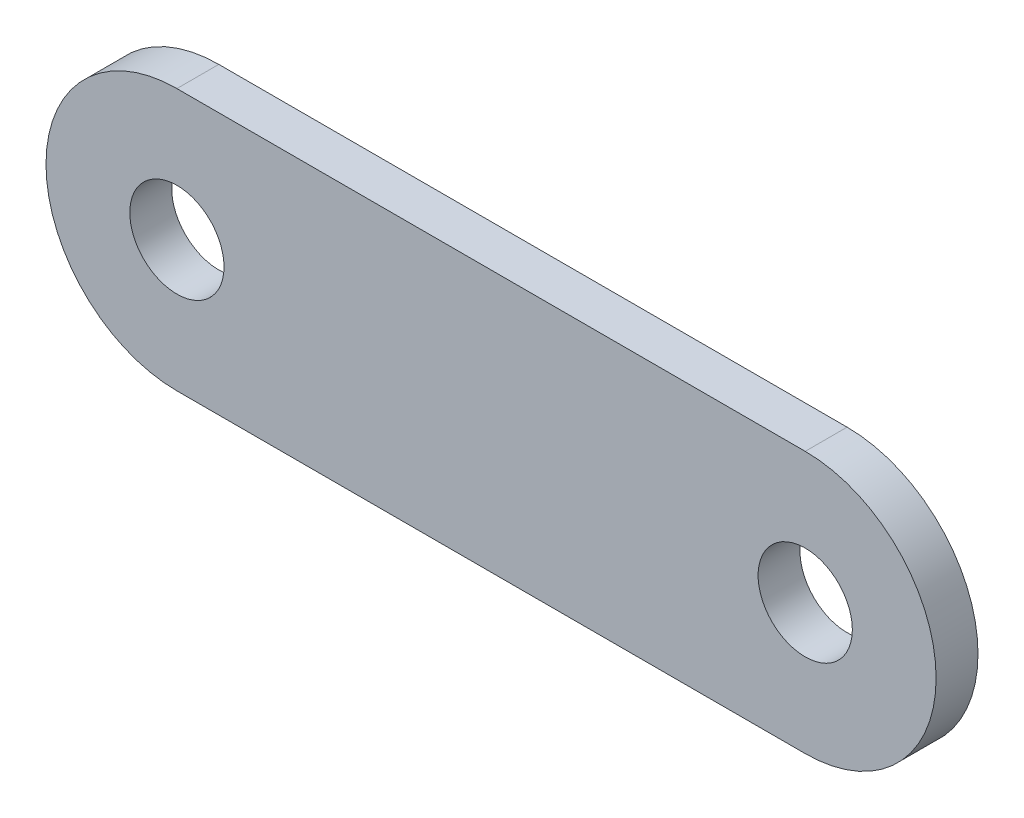
ISO-10303-21;
HEADER;
FILE_DESCRIPTION(('STEP AP214'),'2;1');
FILE_NAME('part.step','',(''),(''),'','','');
FILE_SCHEMA(('AUTOMOTIVE_DESIGN { 1 0 10303 214 1 1 1 1 }'));
ENDSEC;
DATA;
#1=APPLICATION_CONTEXT('core data for automotive mechanical design processes');
#2=APPLICATION_PROTOCOL_DEFINITION('international standard','automotive_design',2000,#1);
#3=PRODUCT_CONTEXT('',#1,'mechanical');
#4=PRODUCT('Part','Part','',(#3));
#5=PRODUCT_RELATED_PRODUCT_CATEGORY('part','',(#4));
#6=PRODUCT_DEFINITION_FORMATION('','',#4);
#7=PRODUCT_DEFINITION_CONTEXT('part definition',#1,'design');
#8=PRODUCT_DEFINITION('design','',#6,#7);
#9=PRODUCT_DEFINITION_SHAPE('','',#8);
#10=(LENGTH_UNIT() NAMED_UNIT(*) SI_UNIT(.MILLI.,.METRE.));
#11=(NAMED_UNIT(*) PLANE_ANGLE_UNIT() SI_UNIT($,.RADIAN.));
#12=(NAMED_UNIT(*) SI_UNIT($,.STERADIAN.) SOLID_ANGLE_UNIT());
#13=UNCERTAINTY_MEASURE_WITH_UNIT(LENGTH_MEASURE(1.E-05),#10,'distance_accuracy_value','');
#14=(GEOMETRIC_REPRESENTATION_CONTEXT(3) GLOBAL_UNCERTAINTY_ASSIGNED_CONTEXT((#13)) GLOBAL_UNIT_ASSIGNED_CONTEXT((#10,
#11,#12)) REPRESENTATION_CONTEXT('',''));
#15=CARTESIAN_POINT('',(0.,0.,0.));
#16=DIRECTION('',(0.,0.,1.));
#17=DIRECTION('',(1.,0.,0.));
#18=AXIS2_PLACEMENT_3D('',#15,#16,#17);
#19=CARTESIAN_POINT('',(0.,0.,4.));
#20=DIRECTION('',(0.,0.,1.));
#21=DIRECTION('',(1.,0.,0.));
#22=AXIS2_PLACEMENT_3D('',#19,#20,#21);
#23=PLANE('',#22);
#24=CARTESIAN_POINT('',(0.,0.,4.));
#25=DIRECTION('',(0.,0.,1.));
#26=DIRECTION('',(1.,0.,0.));
#27=AXIS2_PLACEMENT_3D('',#24,#25,#26);
#28=CIRCLE('',#27,4.5);
#29=CARTESIAN_POINT('',(4.5,0.,4.));
#30=VERTEX_POINT('',#29);
#31=EDGE_CURVE('E100',#30,#30,#28,.T.);
#32=ORIENTED_EDGE('',*,*,#31,.F.);
#33=EDGE_LOOP('',(#32));
#34=FACE_BOUND('',#33,.T.);
#35=CARTESIAN_POINT('',(0.,0.,4.));
#36=DIRECTION('',(0.,0.,1.));
#37=DIRECTION('',(1.,0.,0.));
#38=AXIS2_PLACEMENT_3D('',#35,#36,#37);
#39=CIRCLE('',#38,12.5);
#40=CARTESIAN_POINT('',(0.,12.5,4.));
#41=VERTEX_POINT('',#40);
#42=CARTESIAN_POINT('',(0.,-12.5,4.));
#43=VERTEX_POINT('',#42);
#44=EDGE_CURVE('E85',#41,#43,#39,.T.);
#45=ORIENTED_EDGE('',*,*,#44,.T.);
#46=DIRECTION('',(1.,0.,0.));
#47=VECTOR('',#46,1.);
#48=CARTESIAN_POINT('',(0.,-12.5,4.));
#49=LINE('',#48,#47);
#50=CARTESIAN_POINT('',(60.,-12.5,4.));
#51=VERTEX_POINT('',#50);
#52=EDGE_CURVE('E80',#43,#51,#49,.T.);
#53=ORIENTED_EDGE('',*,*,#52,.T.);
#54=CARTESIAN_POINT('',(60.,0.,4.));
#55=DIRECTION('',(0.,0.,1.));
#56=DIRECTION('',(1.,0.,0.));
#57=AXIS2_PLACEMENT_3D('',#54,#55,#56);
#58=CIRCLE('',#57,12.5);
#59=CARTESIAN_POINT('',(60.,12.5,4.));
#60=VERTEX_POINT('',#59);
#61=EDGE_CURVE('E83',#51,#60,#58,.T.);
#62=ORIENTED_EDGE('',*,*,#61,.T.);
#63=DIRECTION('',(-1.,0.,0.));
#64=VECTOR('',#63,1.);
#65=CARTESIAN_POINT('',(0.,12.5,4.));
#66=LINE('',#65,#64);
#67=EDGE_CURVE('E50',#60,#41,#66,.T.);
#68=ORIENTED_EDGE('',*,*,#67,.T.);
#69=EDGE_LOOP('',(#45,#53,#62,#68));
#70=FACE_BOUND('',#69,.T.);
#71=CARTESIAN_POINT('',(60.,0.,4.));
#72=DIRECTION('',(0.,0.,1.));
#73=DIRECTION('',(1.,0.,0.));
#74=AXIS2_PLACEMENT_3D('',#71,#72,#73);
#75=CIRCLE('',#74,4.5);
#76=CARTESIAN_POINT('',(64.5,0.,4.));
#77=VERTEX_POINT('',#76);
#78=EDGE_CURVE('E115',#77,#77,#75,.T.);
#79=ORIENTED_EDGE('',*,*,#78,.F.);
#80=EDGE_LOOP('',(#79));
#81=FACE_BOUND('',#80,.T.);
#82=ADVANCED_FACE('F33',(#34,#70,#81),#23,.T.);
#83=CARTESIAN_POINT('',(0.,0.,0.));
#84=DIRECTION('',(0.,0.,1.));
#85=DIRECTION('',(1.,0.,0.));
#86=AXIS2_PLACEMENT_3D('',#83,#84,#85);
#87=PLANE('',#86);
#88=CARTESIAN_POINT('',(0.,0.,0.));
#89=DIRECTION('',(0.,0.,1.));
#90=DIRECTION('',(1.,0.,0.));
#91=AXIS2_PLACEMENT_3D('',#88,#89,#90);
#92=CIRCLE('',#91,12.5);
#93=CARTESIAN_POINT('',(0.,12.5,0.));
#94=VERTEX_POINT('',#93);
#95=CARTESIAN_POINT('',(0.,-12.5,0.));
#96=VERTEX_POINT('',#95);
#97=EDGE_CURVE('E97',#94,#96,#92,.T.);
#98=ORIENTED_EDGE('',*,*,#97,.F.);
#99=DIRECTION('',(-1.,0.,0.));
#100=VECTOR('',#99,1.);
#101=CARTESIAN_POINT('',(0.,12.5,0.));
#102=LINE('',#101,#100);
#103=CARTESIAN_POINT('',(60.,12.5,0.));
#104=VERTEX_POINT('',#103);
#105=EDGE_CURVE('E73',#104,#94,#102,.T.);
#106=ORIENTED_EDGE('',*,*,#105,.F.);
#107=CARTESIAN_POINT('',(60.,0.,0.));
#108=DIRECTION('',(0.,0.,1.));
#109=DIRECTION('',(1.,0.,0.));
#110=AXIS2_PLACEMENT_3D('',#107,#108,#109);
#111=CIRCLE('',#110,12.5);
#112=CARTESIAN_POINT('',(60.,-12.5,0.));
#113=VERTEX_POINT('',#112);
#114=EDGE_CURVE('E67',#113,#104,#111,.T.);
#115=ORIENTED_EDGE('',*,*,#114,.F.);
#116=DIRECTION('',(1.,0.,0.));
#117=VECTOR('',#116,1.);
#118=CARTESIAN_POINT('',(0.,-12.5,0.));
#119=LINE('',#118,#117);
#120=EDGE_CURVE('E89',#96,#113,#119,.T.);
#121=ORIENTED_EDGE('',*,*,#120,.F.);
#122=EDGE_LOOP('',(#98,#106,#115,#121));
#123=FACE_BOUND('',#122,.T.);
#124=CARTESIAN_POINT('',(0.,0.,0.));
#125=DIRECTION('',(0.,0.,1.));
#126=DIRECTION('',(1.,0.,0.));
#127=AXIS2_PLACEMENT_3D('',#124,#125,#126);
#128=CIRCLE('',#127,4.5);
#129=CARTESIAN_POINT('',(4.5,0.,0.));
#130=VERTEX_POINT('',#129);
#131=EDGE_CURVE('E112',#130,#130,#128,.T.);
#132=ORIENTED_EDGE('',*,*,#131,.T.);
#133=EDGE_LOOP('',(#132));
#134=FACE_BOUND('',#133,.T.);
#135=CARTESIAN_POINT('',(60.,0.,0.));
#136=DIRECTION('',(0.,0.,1.));
#137=DIRECTION('',(1.,0.,0.));
#138=AXIS2_PLACEMENT_3D('',#135,#136,#137);
#139=CIRCLE('',#138,4.5);
#140=CARTESIAN_POINT('',(64.5,0.,0.));
#141=VERTEX_POINT('',#140);
#142=EDGE_CURVE('E118',#141,#141,#139,.T.);
#143=ORIENTED_EDGE('',*,*,#142,.T.);
#144=EDGE_LOOP('',(#143));
#145=FACE_BOUND('',#144,.T.);
#146=ADVANCED_FACE('F108',(#123,#134,#145),#87,.F.);
#147=CARTESIAN_POINT('',(0.,0.,4.));
#148=DIRECTION('',(0.,0.,-1.));
#149=DIRECTION('',(-1.,0.,0.));
#150=AXIS2_PLACEMENT_3D('',#147,#148,#149);
#151=CYLINDRICAL_SURFACE('',#150,12.5);
#152=ORIENTED_EDGE('',*,*,#97,.T.);
#153=DIRECTION('',(0.,0.,-1.));
#154=VECTOR('',#153,1.);
#155=CARTESIAN_POINT('',(0.,-12.5,4.));
#156=LINE('',#155,#154);
#157=EDGE_CURVE('E11',#43,#96,#156,.T.);
#158=ORIENTED_EDGE('',*,*,#157,.F.);
#159=ORIENTED_EDGE('',*,*,#44,.F.);
#160=DIRECTION('',(0.,0.,-1.));
#161=VECTOR('',#160,1.);
#162=CARTESIAN_POINT('',(0.,12.5,4.));
#163=LINE('',#162,#161);
#164=EDGE_CURVE('E93',#41,#94,#163,.T.);
#165=ORIENTED_EDGE('',*,*,#164,.T.);
#166=EDGE_LOOP('',(#152,#158,#159,#165));
#167=FACE_BOUND('',#166,.T.);
#168=ADVANCED_FACE('F35',(#167),#151,.T.);
#169=CARTESIAN_POINT('',(0.,-12.5,4.));
#170=DIRECTION('',(0.,1.,0.));
#171=DIRECTION('',(0.,0.,1.));
#172=AXIS2_PLACEMENT_3D('',#169,#170,#171);
#173=PLANE('',#172);
#174=ORIENTED_EDGE('',*,*,#120,.T.);
#175=DIRECTION('',(0.,0.,-1.));
#176=VECTOR('',#175,1.);
#177=CARTESIAN_POINT('',(60.,-12.5,4.));
#178=LINE('',#177,#176);
#179=EDGE_CURVE('E42',#51,#113,#178,.T.);
#180=ORIENTED_EDGE('',*,*,#179,.F.);
#181=ORIENTED_EDGE('',*,*,#52,.F.);
#182=ORIENTED_EDGE('',*,*,#157,.T.);
#183=EDGE_LOOP('',(#174,#180,#181,#182));
#184=FACE_BOUND('',#183,.T.);
#185=ADVANCED_FACE('F88',(#184),#173,.F.);
#186=CARTESIAN_POINT('',(60.,0.,4.));
#187=DIRECTION('',(0.,0.,-1.));
#188=DIRECTION('',(-1.,0.,0.));
#189=AXIS2_PLACEMENT_3D('',#186,#187,#188);
#190=CYLINDRICAL_SURFACE('',#189,12.5);
#191=ORIENTED_EDGE('',*,*,#114,.T.);
#192=DIRECTION('',(0.,0.,-1.));
#193=VECTOR('',#192,1.);
#194=CARTESIAN_POINT('',(60.,12.5,4.));
#195=LINE('',#194,#193);
#196=EDGE_CURVE('E90',#60,#104,#195,.T.);
#197=ORIENTED_EDGE('',*,*,#196,.F.);
#198=ORIENTED_EDGE('',*,*,#61,.F.);
#199=ORIENTED_EDGE('',*,*,#179,.T.);
#200=EDGE_LOOP('',(#191,#197,#198,#199));
#201=FACE_BOUND('',#200,.T.);
#202=ADVANCED_FACE('F91',(#201),#190,.T.);
#203=CARTESIAN_POINT('',(0.,12.5,4.));
#204=DIRECTION('',(0.,-1.,0.));
#205=DIRECTION('',(0.,0.,-1.));
#206=AXIS2_PLACEMENT_3D('',#203,#204,#205);
#207=PLANE('',#206);
#208=ORIENTED_EDGE('',*,*,#105,.T.);
#209=ORIENTED_EDGE('',*,*,#164,.F.);
#210=ORIENTED_EDGE('',*,*,#67,.F.);
#211=ORIENTED_EDGE('',*,*,#196,.T.);
#212=EDGE_LOOP('',(#208,#209,#210,#211));
#213=FACE_BOUND('',#212,.T.);
#214=ADVANCED_FACE('F105',(#213),#207,.F.);
#215=CARTESIAN_POINT('',(0.,0.,4.));
#216=DIRECTION('',(0.,0.,-1.));
#217=DIRECTION('',(-1.,0.,0.));
#218=AXIS2_PLACEMENT_3D('',#215,#216,#217);
#219=CYLINDRICAL_SURFACE('',#218,4.5);
#220=ORIENTED_EDGE('',*,*,#31,.T.);
#221=EDGE_LOOP('',(#220));
#222=FACE_BOUND('',#221,.T.);
#223=ORIENTED_EDGE('',*,*,#131,.F.);
#224=EDGE_LOOP('',(#223));
#225=FACE_BOUND('',#224,.T.);
#226=ADVANCED_FACE('F135',(#222,#225),#219,.F.);
#227=CARTESIAN_POINT('',(60.,0.,4.));
#228=DIRECTION('',(0.,0.,-1.));
#229=DIRECTION('',(-1.,0.,0.));
#230=AXIS2_PLACEMENT_3D('',#227,#228,#229);
#231=CYLINDRICAL_SURFACE('',#230,4.5);
#232=ORIENTED_EDGE('',*,*,#78,.T.);
#233=EDGE_LOOP('',(#232));
#234=FACE_BOUND('',#233,.T.);
#235=ORIENTED_EDGE('',*,*,#142,.F.);
#236=EDGE_LOOP('',(#235));
#237=FACE_BOUND('',#236,.T.);
#238=ADVANCED_FACE('F124',(#234,#237),#231,.F.);
#239=CLOSED_SHELL('',(#82,#146,#168,#185,#202,#214,#226,#238));
#240=MANIFOLD_SOLID_BREP('B2',#239);
#241=ADVANCED_BREP_SHAPE_REPRESENTATION('',(#18,#240),#14);
#242=SHAPE_DEFINITION_REPRESENTATION(#9,#241);
ENDSEC;
END-ISO-10303-21;
